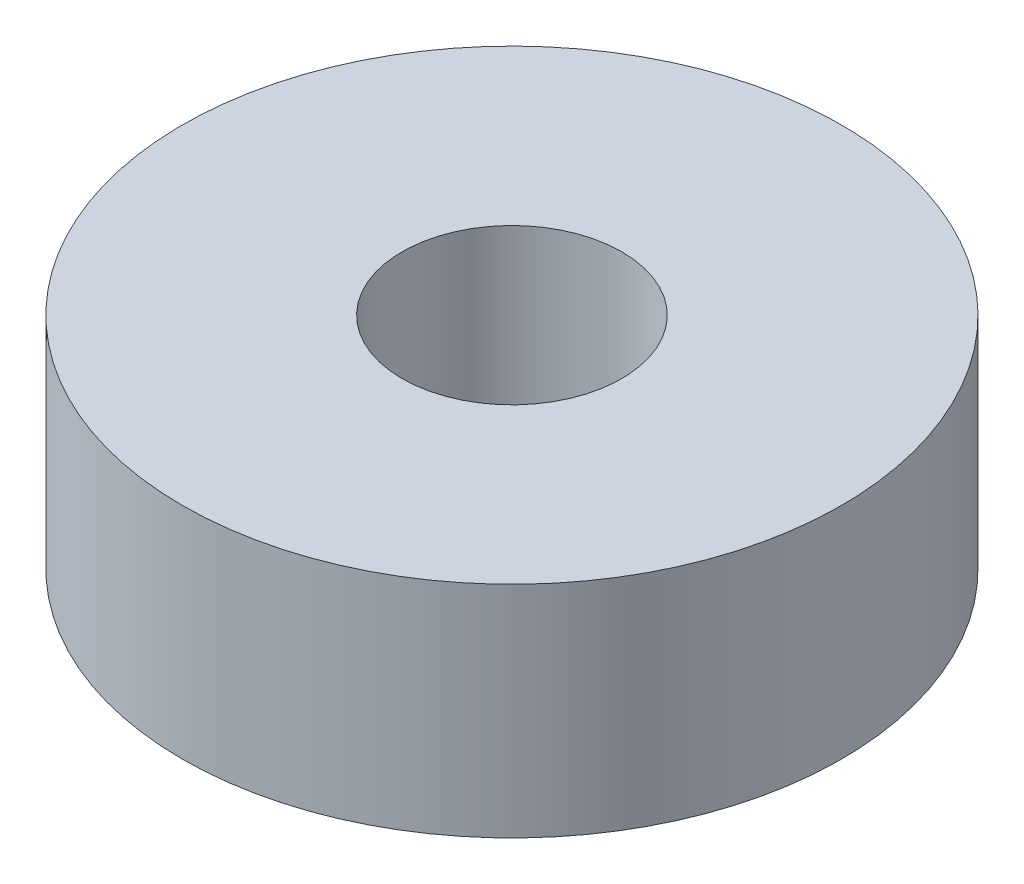
ISO-10303-21;
HEADER;
FILE_DESCRIPTION(('STEP AP214'),'2;1');
FILE_NAME('part.step','',(''),(''),'','','');
FILE_SCHEMA(('AUTOMOTIVE_DESIGN { 1 0 10303 214 1 1 1 1 }'));
ENDSEC;
DATA;
#1=APPLICATION_CONTEXT('core data for automotive mechanical design processes');
#2=APPLICATION_PROTOCOL_DEFINITION('international standard','automotive_design',2000,#1);
#3=PRODUCT_CONTEXT('',#1,'mechanical');
#4=PRODUCT('Part','Part','',(#3));
#5=PRODUCT_RELATED_PRODUCT_CATEGORY('part','',(#4));
#6=PRODUCT_DEFINITION_FORMATION('','',#4);
#7=PRODUCT_DEFINITION_CONTEXT('part definition',#1,'design');
#8=PRODUCT_DEFINITION('design','',#6,#7);
#9=PRODUCT_DEFINITION_SHAPE('','',#8);
#10=(LENGTH_UNIT() NAMED_UNIT(*) SI_UNIT(.MILLI.,.METRE.));
#11=(NAMED_UNIT(*) PLANE_ANGLE_UNIT() SI_UNIT($,.RADIAN.));
#12=(NAMED_UNIT(*) SI_UNIT($,.STERADIAN.) SOLID_ANGLE_UNIT());
#13=UNCERTAINTY_MEASURE_WITH_UNIT(LENGTH_MEASURE(1.E-05),#10,'distance_accuracy_value','');
#14=(GEOMETRIC_REPRESENTATION_CONTEXT(3) GLOBAL_UNCERTAINTY_ASSIGNED_CONTEXT((#13)) GLOBAL_UNIT_ASSIGNED_CONTEXT((#10,
#11,#12)) REPRESENTATION_CONTEXT('',''));
#15=CARTESIAN_POINT('',(0.,0.,0.));
#16=DIRECTION('',(0.,0.,1.));
#17=DIRECTION('',(1.,0.,0.));
#18=AXIS2_PLACEMENT_3D('',#15,#16,#17);
#19=CARTESIAN_POINT('',(0.,3.,0.));
#20=DIRECTION('',(0.,1.,0.));
#21=DIRECTION('',(0.,0.,1.));
#22=AXIS2_PLACEMENT_3D('',#19,#20,#21);
#23=PLANE('',#22);
#24=CARTESIAN_POINT('',(0.,3.,0.));
#25=DIRECTION('',(0.,1.,0.));
#26=DIRECTION('',(0.,0.,1.));
#27=AXIS2_PLACEMENT_3D('',#24,#25,#26);
#28=CIRCLE('',#27,4.5);
#29=CARTESIAN_POINT('',(0.,3.,4.5));
#30=VERTEX_POINT('',#29);
#31=EDGE_CURVE('E10',#30,#30,#28,.T.);
#32=ORIENTED_EDGE('',*,*,#31,.T.);
#33=EDGE_LOOP('',(#32));
#34=FACE_BOUND('',#33,.T.);
#35=CARTESIAN_POINT('',(0.,3.,0.));
#36=DIRECTION('',(0.,1.,0.));
#37=DIRECTION('',(0.,0.,1.));
#38=AXIS2_PLACEMENT_3D('',#35,#36,#37);
#39=CIRCLE('',#38,1.5);
#40=CARTESIAN_POINT('',(0.,3.,1.5));
#41=VERTEX_POINT('',#40);
#42=EDGE_CURVE('E44',#41,#41,#39,.T.);
#43=ORIENTED_EDGE('',*,*,#42,.F.);
#44=EDGE_LOOP('',(#43));
#45=FACE_BOUND('',#44,.T.);
#46=ADVANCED_FACE('F33',(#34,#45),#23,.T.);
#47=CARTESIAN_POINT('',(0.,0.,0.));
#48=DIRECTION('',(0.,1.,0.));
#49=DIRECTION('',(0.,0.,1.));
#50=AXIS2_PLACEMENT_3D('',#47,#48,#49);
#51=PLANE('',#50);
#52=CARTESIAN_POINT('',(0.,0.,0.));
#53=DIRECTION('',(0.,1.,0.));
#54=DIRECTION('',(0.,0.,1.));
#55=AXIS2_PLACEMENT_3D('',#52,#53,#54);
#56=CIRCLE('',#55,4.5);
#57=CARTESIAN_POINT('',(0.,0.,4.5));
#58=VERTEX_POINT('',#57);
#59=EDGE_CURVE('E37',#58,#58,#56,.T.);
#60=ORIENTED_EDGE('',*,*,#59,.F.);
#61=EDGE_LOOP('',(#60));
#62=FACE_BOUND('',#61,.T.);
#63=CARTESIAN_POINT('',(0.,0.,0.));
#64=DIRECTION('',(0.,1.,0.));
#65=DIRECTION('',(0.,0.,1.));
#66=AXIS2_PLACEMENT_3D('',#63,#64,#65);
#67=CIRCLE('',#66,1.5);
#68=CARTESIAN_POINT('',(0.,0.,1.5));
#69=VERTEX_POINT('',#68);
#70=EDGE_CURVE('E46',#69,#69,#67,.T.);
#71=ORIENTED_EDGE('',*,*,#70,.T.);
#72=EDGE_LOOP('',(#71));
#73=FACE_BOUND('',#72,.T.);
#74=ADVANCED_FACE('F56',(#62,#73),#51,.F.);
#75=CARTESIAN_POINT('',(0.,3.,0.));
#76=DIRECTION('',(0.,-1.,0.));
#77=DIRECTION('',(0.,0.,-1.));
#78=AXIS2_PLACEMENT_3D('',#75,#76,#77);
#79=CYLINDRICAL_SURFACE('',#78,4.5);
#80=ORIENTED_EDGE('',*,*,#31,.F.);
#81=EDGE_LOOP('',(#80));
#82=FACE_BOUND('',#81,.T.);
#83=ORIENTED_EDGE('',*,*,#59,.T.);
#84=EDGE_LOOP('',(#83));
#85=FACE_BOUND('',#84,.T.);
#86=ADVANCED_FACE('F35',(#82,#85),#79,.T.);
#87=CARTESIAN_POINT('',(0.,3.,0.));
#88=DIRECTION('',(0.,-1.,0.));
#89=DIRECTION('',(0.,0.,-1.));
#90=AXIS2_PLACEMENT_3D('',#87,#88,#89);
#91=CYLINDRICAL_SURFACE('',#90,1.5);
#92=ORIENTED_EDGE('',*,*,#42,.T.);
#93=EDGE_LOOP('',(#92));
#94=FACE_BOUND('',#93,.T.);
#95=ORIENTED_EDGE('',*,*,#70,.F.);
#96=EDGE_LOOP('',(#95));
#97=FACE_BOUND('',#96,.T.);
#98=ADVANCED_FACE('F52',(#94,#97),#91,.F.);
#99=CLOSED_SHELL('',(#46,#74,#86,#98));
#100=MANIFOLD_SOLID_BREP('B2',#99);
#101=ADVANCED_BREP_SHAPE_REPRESENTATION('',(#18,#100),#14);
#102=SHAPE_DEFINITION_REPRESENTATION(#9,#101);
ENDSEC;
END-ISO-10303-21;
